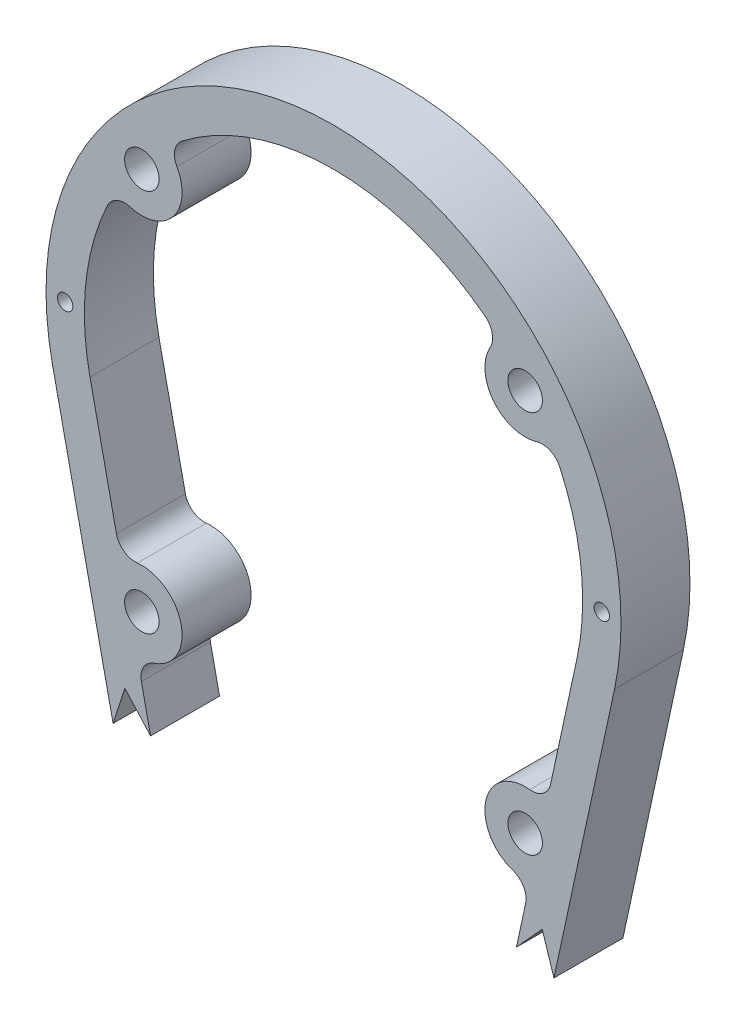
ISO-10303-21;
HEADER;
FILE_DESCRIPTION(('STEP AP214'),'2;1');
FILE_NAME('part.step','',(''),(''),'','','');
FILE_SCHEMA(('AUTOMOTIVE_DESIGN { 1 0 10303 214 1 1 1 1 }'));
ENDSEC;
DATA;
#1=APPLICATION_CONTEXT('core data for automotive mechanical design processes');
#2=APPLICATION_PROTOCOL_DEFINITION('international standard','automotive_design',2000,#1);
#3=PRODUCT_CONTEXT('',#1,'mechanical');
#4=PRODUCT('Part','Part','',(#3));
#5=PRODUCT_RELATED_PRODUCT_CATEGORY('part','',(#4));
#6=PRODUCT_DEFINITION_FORMATION('','',#4);
#7=PRODUCT_DEFINITION_CONTEXT('part definition',#1,'design');
#8=PRODUCT_DEFINITION('design','',#6,#7);
#9=PRODUCT_DEFINITION_SHAPE('','',#8);
#10=(LENGTH_UNIT() NAMED_UNIT(*) SI_UNIT(.MILLI.,.METRE.));
#11=(NAMED_UNIT(*) PLANE_ANGLE_UNIT() SI_UNIT($,.RADIAN.));
#12=(NAMED_UNIT(*) SI_UNIT($,.STERADIAN.) SOLID_ANGLE_UNIT());
#13=UNCERTAINTY_MEASURE_WITH_UNIT(LENGTH_MEASURE(1.E-05),#10,'distance_accuracy_value','');
#14=(GEOMETRIC_REPRESENTATION_CONTEXT(3) GLOBAL_UNCERTAINTY_ASSIGNED_CONTEXT((#13)) GLOBAL_UNIT_ASSIGNED_CONTEXT((#10,
#11,#12)) REPRESENTATION_CONTEXT('',''));
#15=CARTESIAN_POINT('',(0.,0.,0.));
#16=DIRECTION('',(0.,0.,1.));
#17=DIRECTION('',(1.,0.,0.));
#18=AXIS2_PLACEMENT_3D('',#15,#16,#17);
#19=CARTESIAN_POINT('',(-31.9298733487398,-112.5,18.));
#20=DIRECTION('',(0.,0.,1.));
#21=DIRECTION('',(1.,0.,0.));
#22=AXIS2_PLACEMENT_3D('',#19,#20,#21);
#23=PLANE('',#22);
#24=CARTESIAN_POINT('',(70.,47.5,18.));
#25=DIRECTION('',(0.,0.,1.));
#26=DIRECTION('',(1.,0.,0.));
#27=AXIS2_PLACEMENT_3D('',#24,#25,#26);
#28=CIRCLE('',#27,2.);
#29=CARTESIAN_POINT('',(72.,47.5,18.));
#30=VERTEX_POINT('',#29);
#31=EDGE_CURVE('E558',#30,#30,#28,.T.);
#32=ORIENTED_EDGE('',*,*,#31,.F.);
#33=EDGE_LOOP('',(#32));
#34=FACE_BOUND('',#33,.T.);
#35=CARTESIAN_POINT('',(-70.,47.5,18.));
#36=DIRECTION('',(0.,0.,1.));
#37=DIRECTION('',(1.,0.,0.));
#38=AXIS2_PLACEMENT_3D('',#35,#36,#37);
#39=CIRCLE('',#38,2.);
#40=CARTESIAN_POINT('',(-68.,47.5,18.));
#41=VERTEX_POINT('',#40);
#42=EDGE_CURVE('E552',#41,#41,#39,.T.);
#43=ORIENTED_EDGE('',*,*,#42,.F.);
#44=EDGE_LOOP('',(#43));
#45=FACE_BOUND('',#44,.T.);
#46=DIRECTION('',(-0.306753150837407,-0.95178910713,0.));
#47=VECTOR('',#46,1.);
#48=CARTESIAN_POINT('',(-57.5063561450649,-41.4755483598365,18.));
#49=LINE('',#48,#47);
#50=CARTESIAN_POINT('',(-54.4439824625953,-31.9736609139237,18.));
#51=VERTEX_POINT('',#50);
#52=CARTESIAN_POINT('',(-57.5063561450649,-41.4755483598365,18.));
#53=VERTEX_POINT('',#52);
#54=EDGE_CURVE('E218',#51,#53,#49,.T.);
#55=ORIENTED_EDGE('',*,*,#54,.F.);
#56=DIRECTION('',(-0.67089697040122,0.741550574881083,0.));
#57=VECTOR('',#56,1.);
#58=CARTESIAN_POINT('',(-54.4439824625953,-31.9736609139237,18.));
#59=LINE('',#58,#57);
#60=CARTESIAN_POINT('',(-47.7236876934698,-39.4016843948391,18.));
#61=VERTEX_POINT('',#60);
#62=EDGE_CURVE('E543',#61,#51,#59,.T.);
#63=ORIENTED_EDGE('',*,*,#62,.F.);
#64=DIRECTION('',(0.211189373172623,-0.977445164016353,0.));
#65=VECTOR('',#64,1.);
#66=CARTESIAN_POINT('',(-31.9298733487398,-112.5,18.));
#67=LINE('',#66,#65);
#68=CARTESIAN_POINT('',(-50.1212592306133,-28.3050337009208,18.));
#69=VERTEX_POINT('',#68);
#70=EDGE_CURVE('E364',#69,#61,#67,.T.);
#71=ORIENTED_EDGE('',*,*,#70,.F.);
#72=CARTESIAN_POINT('',(-45.2340334105316,-27.2490868350576,18.));
#73=DIRECTION('',(0.,0.,1.));
#74=DIRECTION('',(1.,0.,0.));
#75=AXIS2_PLACEMENT_3D('',#72,#73,#74);
#76=CIRCLE('',#75,5.);
#77=CARTESIAN_POINT('',(-46.7714419877795,-22.4913168882649,18.));
#78=VERTEX_POINT('',#77);
#79=EDGE_CURVE('E306',#69,#78,#76,.F.);
#80=ORIENTED_EDGE('',*,*,#79,.T.);
#81=CARTESIAN_POINT('',(-50.,-12.5,18.));
#82=DIRECTION('',(0.,0.,-1.));
#83=DIRECTION('',(1.,0.,0.));
#84=AXIS2_PLACEMENT_3D('',#81,#82,#83);
#85=CIRCLE('',#84,10.5);
#86=CARTESIAN_POINT('',(-51.1843712947804,-2.06701075261266,18.));
#87=VERTEX_POINT('',#86);
#88=EDGE_CURVE('E361',#87,#78,#85,.T.);
#89=ORIENTED_EDGE('',*,*,#88,.F.);
#90=CARTESIAN_POINT('',(-51.7483576256283,2.90107936519085,18.));
#91=DIRECTION('',(0.,0.,1.));
#92=DIRECTION('',(1.,0.,0.));
#93=AXIS2_PLACEMENT_3D('',#90,#91,#92);
#94=CIRCLE('',#93,5.);
#95=CARTESIAN_POINT('',(-56.63558344571,1.84513249932773,18.));
#96=VERTEX_POINT('',#95);
#97=EDGE_CURVE('E293',#87,#96,#94,.F.);
#98=ORIENTED_EDGE('',*,*,#97,.T.);
#99=DIRECTION('',(0.211189373172623,-0.977445164016353,0.));
#100=VECTOR('',#99,1.);
#101=CARTESIAN_POINT('',(-55.4723236772757,-3.53876830055558,18.));
#102=LINE('',#101,#100);
#103=CARTESIAN_POINT('',(-63.5339356610629,33.7726907437795,18.));
#104=VERTEX_POINT('',#103);
#105=EDGE_CURVE('E352',#104,#96,#102,.T.);
#106=ORIENTED_EDGE('',*,*,#105,.F.);
#107=CARTESIAN_POINT('',(0.,47.5,18.));
#108=DIRECTION('',(0.,0.,1.));
#109=DIRECTION('',(1.,0.,0.));
#110=AXIS2_PLACEMENT_3D('',#107,#108,#109);
#111=CIRCLE('',#110,65.);
#112=CARTESIAN_POINT('',(-59.0097536999229,74.755255791763,18.));
#113=VERTEX_POINT('',#112);
#114=EDGE_CURVE('E346',#113,#104,#111,.T.);
#115=ORIENTED_EDGE('',*,*,#114,.F.);
#116=CARTESIAN_POINT('',(-54.4705418768519,72.6586976539351,18.));
#117=DIRECTION('',(0.,0.,1.));
#118=DIRECTION('',(1.,0.,0.));
#119=AXIS2_PLACEMENT_3D('',#116,#117,#118);
#120=CIRCLE('',#119,5.);
#121=CARTESIAN_POINT('',(-53.0284315939965,77.4462145397625,18.));
#122=VERTEX_POINT('',#121);
#123=EDGE_CURVE('E11',#113,#122,#120,.F.);
#124=ORIENTED_EDGE('',*,*,#123,.T.);
#125=CARTESIAN_POINT('',(-50.,87.5,18.));
#126=DIRECTION('',(0.,0.,-1.));
#127=DIRECTION('',(1.,0.,0.));
#128=AXIS2_PLACEMENT_3D('',#125,#126,#127);
#129=CIRCLE('',#128,10.5);
#130=CARTESIAN_POINT('',(-40.8562064862553,92.661495924439,18.));
#131=VERTEX_POINT('',#130);
#132=EDGE_CURVE('E343',#131,#122,#129,.T.);
#133=ORIENTED_EDGE('',*,*,#132,.F.);
#134=CARTESIAN_POINT('',(-36.5020190987578,95.1193511265528,18.));
#135=DIRECTION('',(0.,0.,1.));
#136=DIRECTION('',(1.,0.,0.));
#137=AXIS2_PLACEMENT_3D('',#134,#135,#136);
#138=CIRCLE('',#137,5.);
#139=CARTESIAN_POINT('',(-39.5438540236543,99.0876303870988,18.));
#140=VERTEX_POINT('',#139);
#141=EDGE_CURVE('E318',#131,#140,#138,.F.);
#142=ORIENTED_EDGE('',*,*,#141,.T.);
#143=CARTESIAN_POINT('',(0.,47.5,18.));
#144=DIRECTION('',(0.,0.,1.));
#145=DIRECTION('',(1.,0.,0.));
#146=AXIS2_PLACEMENT_3D('',#143,#144,#145);
#147=CIRCLE('',#146,65.);
#148=CARTESIAN_POINT('',(39.5438540236543,99.0876303870988,18.));
#149=VERTEX_POINT('',#148);
#150=EDGE_CURVE('E350',#149,#140,#147,.T.);
#151=ORIENTED_EDGE('',*,*,#150,.F.);
#152=CARTESIAN_POINT('',(36.5020190987578,95.1193511265527,18.));
#153=DIRECTION('',(0.,0.,1.));
#154=DIRECTION('',(1.,0.,0.));
#155=AXIS2_PLACEMENT_3D('',#152,#153,#154);
#156=CIRCLE('',#155,5.);
#157=CARTESIAN_POINT('',(40.8562064862553,92.6614959244389,18.));
#158=VERTEX_POINT('',#157);
#159=EDGE_CURVE('E314',#149,#158,#156,.F.);
#160=ORIENTED_EDGE('',*,*,#159,.T.);
#161=CARTESIAN_POINT('',(50.,87.5,18.));
#162=DIRECTION('',(0.,0.,-1.));
#163=DIRECTION('',(1.,0.,0.));
#164=AXIS2_PLACEMENT_3D('',#161,#162,#163);
#165=CIRCLE('',#164,10.5);
#166=CARTESIAN_POINT('',(53.0284315939965,77.4462145397625,18.));
#167=VERTEX_POINT('',#166);
#168=EDGE_CURVE('E355',#167,#158,#165,.T.);
#169=ORIENTED_EDGE('',*,*,#168,.F.);
#170=CARTESIAN_POINT('',(54.470541876852,72.6586976539351,18.));
#171=DIRECTION('',(0.,0.,1.));
#172=DIRECTION('',(1.,0.,0.));
#173=AXIS2_PLACEMENT_3D('',#170,#171,#172);
#174=CIRCLE('',#173,5.);
#175=CARTESIAN_POINT('',(59.009753699923,74.755255791763,18.));
#176=VERTEX_POINT('',#175);
#177=EDGE_CURVE('E310',#167,#176,#174,.F.);
#178=ORIENTED_EDGE('',*,*,#177,.T.);
#179=CARTESIAN_POINT('',(0.,47.5,18.));
#180=DIRECTION('',(0.,0.,1.));
#181=DIRECTION('',(1.,0.,0.));
#182=AXIS2_PLACEMENT_3D('',#179,#180,#181);
#183=CIRCLE('',#182,65.);
#184=CARTESIAN_POINT('',(63.5339356610629,33.7726907437795,18.));
#185=VERTEX_POINT('',#184);
#186=EDGE_CURVE('E446',#185,#176,#183,.T.);
#187=ORIENTED_EDGE('',*,*,#186,.F.);
#188=DIRECTION('',(0.211189373172623,0.977445164016353,0.));
#189=VECTOR('',#188,1.);
#190=CARTESIAN_POINT('',(55.4723236772757,-3.53876830055554,18.));
#191=LINE('',#190,#189);
#192=CARTESIAN_POINT('',(56.63558344571,1.84513249932773,18.));
#193=VERTEX_POINT('',#192);
#194=EDGE_CURVE('E444',#193,#185,#191,.T.);
#195=ORIENTED_EDGE('',*,*,#194,.F.);
#196=CARTESIAN_POINT('',(51.7483576256282,2.90107936519085,18.));
#197=DIRECTION('',(0.,0.,1.));
#198=DIRECTION('',(1.,0.,0.));
#199=AXIS2_PLACEMENT_3D('',#196,#197,#198);
#200=CIRCLE('',#199,5.);
#201=CARTESIAN_POINT('',(51.1843712947804,-2.06701075261265,18.));
#202=VERTEX_POINT('',#201);
#203=EDGE_CURVE('E297',#193,#202,#200,.F.);
#204=ORIENTED_EDGE('',*,*,#203,.T.);
#205=CARTESIAN_POINT('',(50.,-12.5,18.));
#206=DIRECTION('',(0.,0.,-1.));
#207=DIRECTION('',(1.,0.,0.));
#208=AXIS2_PLACEMENT_3D('',#205,#206,#207);
#209=CIRCLE('',#208,10.5);
#210=CARTESIAN_POINT('',(46.7714419877795,-22.4913168882648,18.));
#211=VERTEX_POINT('',#210);
#212=EDGE_CURVE('E394',#211,#202,#209,.T.);
#213=ORIENTED_EDGE('',*,*,#212,.F.);
#214=CARTESIAN_POINT('',(45.2340334105316,-27.2490868350576,18.));
#215=DIRECTION('',(0.,0.,1.));
#216=DIRECTION('',(1.,0.,0.));
#217=AXIS2_PLACEMENT_3D('',#214,#215,#216);
#218=CIRCLE('',#217,5.);
#219=CARTESIAN_POINT('',(50.1212592306133,-28.3050337009207,18.));
#220=VERTEX_POINT('',#219);
#221=EDGE_CURVE('E301',#211,#220,#218,.F.);
#222=ORIENTED_EDGE('',*,*,#221,.T.);
#223=DIRECTION('',(0.211189373172623,0.977445164016353,0.));
#224=VECTOR('',#223,1.);
#225=CARTESIAN_POINT('',(31.9298733487398,-112.5,18.));
#226=LINE('',#225,#224);
#227=CARTESIAN_POINT('',(47.7244032118376,-39.3983727700264,18.));
#228=VERTEX_POINT('',#227);
#229=EDGE_CURVE('E367',#228,#220,#226,.T.);
#230=ORIENTED_EDGE('',*,*,#229,.F.);
#231=DIRECTION('',(-0.670959777554308,-0.741493747043273,0.));
#232=VECTOR('',#231,1.);
#233=CARTESIAN_POINT('',(47.7244032118376,-39.3983727700264,18.));
#234=LINE('',#233,#232);
#235=CARTESIAN_POINT('',(54.4443390688109,-31.9720104377862,18.));
#236=VERTEX_POINT('',#235);
#237=EDGE_CURVE('E58',#236,#228,#234,.T.);
#238=ORIENTED_EDGE('',*,*,#237,.F.);
#239=DIRECTION('',(-0.306672532909785,0.951815085801174,0.));
#240=VECTOR('',#239,1.);
#241=CARTESIAN_POINT('',(54.4443390688109,-31.9720104377862,18.));
#242=LINE('',#241,#240);
#243=CARTESIAN_POINT('',(57.5063561450649,-41.4755483598365,18.));
#244=VERTEX_POINT('',#243);
#245=EDGE_CURVE('E542',#244,#236,#242,.T.);
#246=ORIENTED_EDGE('',*,*,#245,.F.);
#247=DIRECTION('',(0.211189373172623,0.977445164016353,0.));
#248=VECTOR('',#247,1.);
#249=CARTESIAN_POINT('',(41.7043249889033,-114.611893731726,18.));
#250=LINE('',#249,#248);
#251=CARTESIAN_POINT('',(73.3083873012265,31.6607970120533,18.));
#252=VERTEX_POINT('',#251);
#253=EDGE_CURVE('E226',#244,#252,#250,.T.);
#254=ORIENTED_EDGE('',*,*,#253,.T.);
#255=CARTESIAN_POINT('',(0.,47.5,18.));
#256=DIRECTION('',(0.,0.,1.));
#257=DIRECTION('',(1.,0.,0.));
#258=AXIS2_PLACEMENT_3D('',#255,#256,#257);
#259=CIRCLE('',#258,75.);
#260=CARTESIAN_POINT('',(-73.3083873012264,31.6607970120533,18.));
#261=VERTEX_POINT('',#260);
#262=EDGE_CURVE('E419',#252,#261,#259,.T.);
#263=ORIENTED_EDGE('',*,*,#262,.T.);
#264=DIRECTION('',(0.211189373172623,-0.977445164016353,0.));
#265=VECTOR('',#264,1.);
#266=CARTESIAN_POINT('',(-73.3083873012264,31.6607970120533,18.));
#267=LINE('',#266,#265);
#268=EDGE_CURVE('E241',#261,#53,#267,.T.);
#269=ORIENTED_EDGE('',*,*,#268,.T.);
#270=EDGE_LOOP('',(#55,#63,#71,#80,#89,#98,#106,#115,#124,#133,#142,#151,#160,#169,#178,#187,
#195,#204,#213,#222,#230,#238,#246,#254,#263,#269));
#271=FACE_BOUND('',#270,.T.);
#272=CARTESIAN_POINT('',(-50.,87.5,18.));
#273=DIRECTION('',(0.,0.,1.));
#274=DIRECTION('',(1.,0.,0.));
#275=AXIS2_PLACEMENT_3D('',#272,#273,#274);
#276=CIRCLE('',#275,4.5);
#277=CARTESIAN_POINT('',(-45.5,87.5,18.));
#278=VERTEX_POINT('',#277);
#279=EDGE_CURVE('E406',#278,#278,#276,.T.);
#280=ORIENTED_EDGE('',*,*,#279,.F.);
#281=EDGE_LOOP('',(#280));
#282=FACE_BOUND('',#281,.T.);
#283=CARTESIAN_POINT('',(50.,-12.5,18.));
#284=DIRECTION('',(0.,0.,1.));
#285=DIRECTION('',(1.,0.,0.));
#286=AXIS2_PLACEMENT_3D('',#283,#284,#285);
#287=CIRCLE('',#286,4.5);
#288=CARTESIAN_POINT('',(54.5,-12.5,18.));
#289=VERTEX_POINT('',#288);
#290=EDGE_CURVE('E233',#289,#289,#287,.T.);
#291=ORIENTED_EDGE('',*,*,#290,.F.);
#292=EDGE_LOOP('',(#291));
#293=FACE_BOUND('',#292,.T.);
#294=CARTESIAN_POINT('',(50.,87.5,18.));
#295=DIRECTION('',(0.,0.,1.));
#296=DIRECTION('',(1.,0.,0.));
#297=AXIS2_PLACEMENT_3D('',#294,#295,#296);
#298=CIRCLE('',#297,4.5);
#299=CARTESIAN_POINT('',(54.5,87.5,18.));
#300=VERTEX_POINT('',#299);
#301=EDGE_CURVE('E412',#300,#300,#298,.T.);
#302=ORIENTED_EDGE('',*,*,#301,.F.);
#303=EDGE_LOOP('',(#302));
#304=FACE_BOUND('',#303,.T.);
#305=CARTESIAN_POINT('',(-50.,-12.5,18.));
#306=DIRECTION('',(0.,0.,1.));
#307=DIRECTION('',(1.,0.,0.));
#308=AXIS2_PLACEMENT_3D('',#305,#306,#307);
#309=CIRCLE('',#308,4.5);
#310=CARTESIAN_POINT('',(-45.5,-12.5,18.));
#311=VERTEX_POINT('',#310);
#312=EDGE_CURVE('E400',#311,#311,#309,.T.);
#313=ORIENTED_EDGE('',*,*,#312,.F.);
#314=EDGE_LOOP('',(#313));
#315=FACE_BOUND('',#314,.T.);
#316=ADVANCED_FACE('F35',(#34,#45,#271,#282,#293,#304,#315),#23,.T.);
#317=CARTESIAN_POINT('',(-31.9298733487398,-112.5,0.));
#318=DIRECTION('',(0.,0.,1.));
#319=DIRECTION('',(1.,0.,0.));
#320=AXIS2_PLACEMENT_3D('',#317,#318,#319);
#321=PLANE('',#320);
#322=CARTESIAN_POINT('',(70.,47.5,0.));
#323=DIRECTION('',(0.,0.,1.));
#324=DIRECTION('',(1.,0.,0.));
#325=AXIS2_PLACEMENT_3D('',#322,#323,#324);
#326=CIRCLE('',#325,2.);
#327=CARTESIAN_POINT('',(72.,47.5,0.));
#328=VERTEX_POINT('',#327);
#329=EDGE_CURVE('E555',#328,#328,#326,.T.);
#330=ORIENTED_EDGE('',*,*,#329,.T.);
#331=EDGE_LOOP('',(#330));
#332=FACE_BOUND('',#331,.T.);
#333=CARTESIAN_POINT('',(-70.,47.5,0.));
#334=DIRECTION('',(0.,0.,1.));
#335=DIRECTION('',(1.,0.,0.));
#336=AXIS2_PLACEMENT_3D('',#333,#334,#335);
#337=CIRCLE('',#336,2.);
#338=CARTESIAN_POINT('',(-68.,47.5,0.));
#339=VERTEX_POINT('',#338);
#340=EDGE_CURVE('E546',#339,#339,#337,.T.);
#341=ORIENTED_EDGE('',*,*,#340,.T.);
#342=EDGE_LOOP('',(#341));
#343=FACE_BOUND('',#342,.T.);
#344=CARTESIAN_POINT('',(-50.,-12.5,0.));
#345=DIRECTION('',(0.,0.,1.));
#346=DIRECTION('',(1.,0.,0.));
#347=AXIS2_PLACEMENT_3D('',#344,#345,#346);
#348=CIRCLE('',#347,4.5);
#349=CARTESIAN_POINT('',(-45.5,-12.5,0.));
#350=VERTEX_POINT('',#349);
#351=EDGE_CURVE('E399',#350,#350,#348,.T.);
#352=ORIENTED_EDGE('',*,*,#351,.T.);
#353=EDGE_LOOP('',(#352));
#354=FACE_BOUND('',#353,.T.);
#355=CARTESIAN_POINT('',(-50.,87.5,0.));
#356=DIRECTION('',(0.,0.,1.));
#357=DIRECTION('',(1.,0.,0.));
#358=AXIS2_PLACEMENT_3D('',#355,#356,#357);
#359=CIRCLE('',#358,4.5);
#360=CARTESIAN_POINT('',(-45.5,87.5,0.));
#361=VERTEX_POINT('',#360);
#362=EDGE_CURVE('E403',#361,#361,#359,.T.);
#363=ORIENTED_EDGE('',*,*,#362,.T.);
#364=EDGE_LOOP('',(#363));
#365=FACE_BOUND('',#364,.T.);
#366=CARTESIAN_POINT('',(50.,87.5,0.));
#367=DIRECTION('',(0.,0.,1.));
#368=DIRECTION('',(1.,0.,0.));
#369=AXIS2_PLACEMENT_3D('',#366,#367,#368);
#370=CIRCLE('',#369,4.5);
#371=CARTESIAN_POINT('',(54.5,87.5,0.));
#372=VERTEX_POINT('',#371);
#373=EDGE_CURVE('E409',#372,#372,#370,.T.);
#374=ORIENTED_EDGE('',*,*,#373,.T.);
#375=EDGE_LOOP('',(#374));
#376=FACE_BOUND('',#375,.T.);
#377=CARTESIAN_POINT('',(50.,-12.5,0.));
#378=DIRECTION('',(0.,0.,1.));
#379=DIRECTION('',(1.,0.,0.));
#380=AXIS2_PLACEMENT_3D('',#377,#378,#379);
#381=CIRCLE('',#380,4.5);
#382=CARTESIAN_POINT('',(54.5,-12.5,0.));
#383=VERTEX_POINT('',#382);
#384=EDGE_CURVE('E238',#383,#383,#381,.T.);
#385=ORIENTED_EDGE('',*,*,#384,.T.);
#386=EDGE_LOOP('',(#385));
#387=FACE_BOUND('',#386,.T.);
#388=DIRECTION('',(-0.67089697040122,0.741550574881083,0.));
#389=VECTOR('',#388,1.);
#390=CARTESIAN_POINT('',(-54.4439824625953,-31.9736609139237,0.));
#391=LINE('',#390,#389);
#392=CARTESIAN_POINT('',(-47.7236876934698,-39.4016843948391,0.));
#393=VERTEX_POINT('',#392);
#394=CARTESIAN_POINT('',(-54.4439824625953,-31.9736609139237,0.));
#395=VERTEX_POINT('',#394);
#396=EDGE_CURVE('E50',#393,#395,#391,.T.);
#397=ORIENTED_EDGE('',*,*,#396,.T.);
#398=DIRECTION('',(-0.306753150837407,-0.95178910713,0.));
#399=VECTOR('',#398,1.);
#400=CARTESIAN_POINT('',(-57.5063561450649,-41.4755483598365,0.));
#401=LINE('',#400,#399);
#402=CARTESIAN_POINT('',(-57.5063561450649,-41.4755483598365,0.));
#403=VERTEX_POINT('',#402);
#404=EDGE_CURVE('E227',#395,#403,#401,.T.);
#405=ORIENTED_EDGE('',*,*,#404,.T.);
#406=DIRECTION('',(0.211189373172623,-0.977445164016353,0.));
#407=VECTOR('',#406,1.);
#408=CARTESIAN_POINT('',(-73.3083873012264,31.6607970120533,0.));
#409=LINE('',#408,#407);
#410=CARTESIAN_POINT('',(-73.3083873012264,31.6607970120533,0.));
#411=VERTEX_POINT('',#410);
#412=EDGE_CURVE('E235',#411,#403,#409,.T.);
#413=ORIENTED_EDGE('',*,*,#412,.F.);
#414=CARTESIAN_POINT('',(0.,47.5,0.));
#415=DIRECTION('',(0.,0.,1.));
#416=DIRECTION('',(1.,0.,0.));
#417=AXIS2_PLACEMENT_3D('',#414,#415,#416);
#418=CIRCLE('',#417,75.);
#419=CARTESIAN_POINT('',(73.3083873012265,31.6607970120533,0.));
#420=VERTEX_POINT('',#419);
#421=EDGE_CURVE('E232',#420,#411,#418,.T.);
#422=ORIENTED_EDGE('',*,*,#421,.F.);
#423=DIRECTION('',(0.211189373172623,0.977445164016353,0.));
#424=VECTOR('',#423,1.);
#425=CARTESIAN_POINT('',(41.7043249889033,-114.611893731726,0.));
#426=LINE('',#425,#424);
#427=CARTESIAN_POINT('',(57.5063561450649,-41.4755483598365,0.));
#428=VERTEX_POINT('',#427);
#429=EDGE_CURVE('E224',#428,#420,#426,.T.);
#430=ORIENTED_EDGE('',*,*,#429,.F.);
#431=DIRECTION('',(-0.306672532909785,0.951815085801174,0.));
#432=VECTOR('',#431,1.);
#433=CARTESIAN_POINT('',(54.4443390688109,-31.9720104377862,0.));
#434=LINE('',#433,#432);
#435=CARTESIAN_POINT('',(54.4443390688109,-31.9720104377862,0.));
#436=VERTEX_POINT('',#435);
#437=EDGE_CURVE('E206',#428,#436,#434,.T.);
#438=ORIENTED_EDGE('',*,*,#437,.T.);
#439=DIRECTION('',(-0.670959777554308,-0.741493747043273,0.));
#440=VECTOR('',#439,1.);
#441=CARTESIAN_POINT('',(47.7244032118376,-39.3983727700264,0.));
#442=LINE('',#441,#440);
#443=CARTESIAN_POINT('',(47.7244032118376,-39.3983727700264,0.));
#444=VERTEX_POINT('',#443);
#445=EDGE_CURVE('E217',#436,#444,#442,.T.);
#446=ORIENTED_EDGE('',*,*,#445,.T.);
#447=DIRECTION('',(0.211189373172623,0.977445164016353,0.));
#448=VECTOR('',#447,1.);
#449=CARTESIAN_POINT('',(31.9298733487398,-112.5,0.));
#450=LINE('',#449,#448);
#451=CARTESIAN_POINT('',(50.1212592306133,-28.3050337009207,0.));
#452=VERTEX_POINT('',#451);
#453=EDGE_CURVE('E392',#444,#452,#450,.T.);
#454=ORIENTED_EDGE('',*,*,#453,.T.);
#455=CARTESIAN_POINT('',(45.2340334105316,-27.2490868350576,0.));
#456=DIRECTION('',(0.,0.,1.));
#457=DIRECTION('',(1.,0.,0.));
#458=AXIS2_PLACEMENT_3D('',#455,#456,#457);
#459=CIRCLE('',#458,5.);
#460=CARTESIAN_POINT('',(46.7714419877795,-22.4913168882648,0.));
#461=VERTEX_POINT('',#460);
#462=EDGE_CURVE('E299',#452,#461,#459,.T.);
#463=ORIENTED_EDGE('',*,*,#462,.T.);
#464=CARTESIAN_POINT('',(50.,-12.5,0.));
#465=DIRECTION('',(0.,0.,-1.));
#466=DIRECTION('',(1.,0.,0.));
#467=AXIS2_PLACEMENT_3D('',#464,#465,#466);
#468=CIRCLE('',#467,10.5);
#469=CARTESIAN_POINT('',(51.1843712947804,-2.06701075261265,0.));
#470=VERTEX_POINT('',#469);
#471=EDGE_CURVE('E369',#461,#470,#468,.T.);
#472=ORIENTED_EDGE('',*,*,#471,.T.);
#473=CARTESIAN_POINT('',(51.7483576256282,2.90107936519085,0.));
#474=DIRECTION('',(0.,0.,1.));
#475=DIRECTION('',(1.,0.,0.));
#476=AXIS2_PLACEMENT_3D('',#473,#474,#475);
#477=CIRCLE('',#476,5.);
#478=CARTESIAN_POINT('',(56.63558344571,1.84513249932773,0.));
#479=VERTEX_POINT('',#478);
#480=EDGE_CURVE('E295',#470,#479,#477,.T.);
#481=ORIENTED_EDGE('',*,*,#480,.T.);
#482=DIRECTION('',(0.211189373172623,0.977445164016353,0.));
#483=VECTOR('',#482,1.);
#484=CARTESIAN_POINT('',(55.4723236772757,-3.53876830055554,0.));
#485=LINE('',#484,#483);
#486=CARTESIAN_POINT('',(63.5339356610629,33.7726907437795,0.));
#487=VERTEX_POINT('',#486);
#488=EDGE_CURVE('E372',#479,#487,#485,.T.);
#489=ORIENTED_EDGE('',*,*,#488,.T.);
#490=CARTESIAN_POINT('',(0.,47.5,0.));
#491=DIRECTION('',(0.,0.,1.));
#492=DIRECTION('',(1.,0.,0.));
#493=AXIS2_PLACEMENT_3D('',#490,#491,#492);
#494=CIRCLE('',#493,65.);
#495=CARTESIAN_POINT('',(59.009753699923,74.755255791763,0.));
#496=VERTEX_POINT('',#495);
#497=EDGE_CURVE('E375',#487,#496,#494,.T.);
#498=ORIENTED_EDGE('',*,*,#497,.T.);
#499=CARTESIAN_POINT('',(54.470541876852,72.6586976539351,0.));
#500=DIRECTION('',(0.,0.,1.));
#501=DIRECTION('',(1.,0.,0.));
#502=AXIS2_PLACEMENT_3D('',#499,#500,#501);
#503=CIRCLE('',#502,5.);
#504=CARTESIAN_POINT('',(53.0284315939965,77.4462145397625,0.));
#505=VERTEX_POINT('',#504);
#506=EDGE_CURVE('E308',#496,#505,#503,.T.);
#507=ORIENTED_EDGE('',*,*,#506,.T.);
#508=CARTESIAN_POINT('',(50.,87.5,0.));
#509=DIRECTION('',(0.,0.,-1.));
#510=DIRECTION('',(1.,0.,0.));
#511=AXIS2_PLACEMENT_3D('',#508,#509,#510);
#512=CIRCLE('',#511,10.5);
#513=CARTESIAN_POINT('',(40.8562064862553,92.6614959244389,0.));
#514=VERTEX_POINT('',#513);
#515=EDGE_CURVE('E378',#505,#514,#512,.T.);
#516=ORIENTED_EDGE('',*,*,#515,.T.);
#517=CARTESIAN_POINT('',(36.5020190987578,95.1193511265527,0.));
#518=DIRECTION('',(0.,0.,1.));
#519=DIRECTION('',(1.,0.,0.));
#520=AXIS2_PLACEMENT_3D('',#517,#518,#519);
#521=CIRCLE('',#520,5.);
#522=CARTESIAN_POINT('',(39.5438540236543,99.0876303870988,0.));
#523=VERTEX_POINT('',#522);
#524=EDGE_CURVE('E312',#514,#523,#521,.T.);
#525=ORIENTED_EDGE('',*,*,#524,.T.);
#526=CARTESIAN_POINT('',(0.,47.5,0.));
#527=DIRECTION('',(0.,0.,1.));
#528=DIRECTION('',(1.,0.,0.));
#529=AXIS2_PLACEMENT_3D('',#526,#527,#528);
#530=CIRCLE('',#529,65.);
#531=CARTESIAN_POINT('',(-39.5438540236543,99.0876303870988,0.));
#532=VERTEX_POINT('',#531);
#533=EDGE_CURVE('E381',#523,#532,#530,.T.);
#534=ORIENTED_EDGE('',*,*,#533,.T.);
#535=CARTESIAN_POINT('',(-36.5020190987578,95.1193511265528,0.));
#536=DIRECTION('',(0.,0.,1.));
#537=DIRECTION('',(1.,0.,0.));
#538=AXIS2_PLACEMENT_3D('',#535,#536,#537);
#539=CIRCLE('',#538,5.);
#540=CARTESIAN_POINT('',(-40.8562064862553,92.661495924439,0.));
#541=VERTEX_POINT('',#540);
#542=EDGE_CURVE('E316',#532,#541,#539,.T.);
#543=ORIENTED_EDGE('',*,*,#542,.T.);
#544=CARTESIAN_POINT('',(-50.,87.5,0.));
#545=DIRECTION('',(0.,0.,-1.));
#546=DIRECTION('',(1.,0.,0.));
#547=AXIS2_PLACEMENT_3D('',#544,#545,#546);
#548=CIRCLE('',#547,10.5);
#549=CARTESIAN_POINT('',(-53.0284315939965,77.4462145397625,0.));
#550=VERTEX_POINT('',#549);
#551=EDGE_CURVE('E325',#541,#550,#548,.T.);
#552=ORIENTED_EDGE('',*,*,#551,.T.);
#553=CARTESIAN_POINT('',(-54.4705418768519,72.6586976539351,0.));
#554=DIRECTION('',(0.,0.,1.));
#555=DIRECTION('',(1.,0.,0.));
#556=AXIS2_PLACEMENT_3D('',#553,#554,#555);
#557=CIRCLE('',#556,5.);
#558=CARTESIAN_POINT('',(-59.0097536999229,74.755255791763,0.));
#559=VERTEX_POINT('',#558);
#560=EDGE_CURVE('E43',#550,#559,#557,.T.);
#561=ORIENTED_EDGE('',*,*,#560,.T.);
#562=CARTESIAN_POINT('',(0.,47.5,0.));
#563=DIRECTION('',(0.,0.,1.));
#564=DIRECTION('',(1.,0.,0.));
#565=AXIS2_PLACEMENT_3D('',#562,#563,#564);
#566=CIRCLE('',#565,65.);
#567=CARTESIAN_POINT('',(-63.5339356610629,33.7726907437795,0.));
#568=VERTEX_POINT('',#567);
#569=EDGE_CURVE('E322',#559,#568,#566,.T.);
#570=ORIENTED_EDGE('',*,*,#569,.T.);
#571=DIRECTION('',(0.211189373172623,-0.977445164016353,0.));
#572=VECTOR('',#571,1.);
#573=CARTESIAN_POINT('',(-55.4723236772757,-3.53876830055558,0.));
#574=LINE('',#573,#572);
#575=CARTESIAN_POINT('',(-56.63558344571,1.84513249932773,0.));
#576=VERTEX_POINT('',#575);
#577=EDGE_CURVE('E335',#568,#576,#574,.T.);
#578=ORIENTED_EDGE('',*,*,#577,.T.);
#579=CARTESIAN_POINT('',(-51.7483576256283,2.90107936519085,0.));
#580=DIRECTION('',(0.,0.,1.));
#581=DIRECTION('',(1.,0.,0.));
#582=AXIS2_PLACEMENT_3D('',#579,#580,#581);
#583=CIRCLE('',#582,5.);
#584=CARTESIAN_POINT('',(-51.1843712947804,-2.06701075261266,0.));
#585=VERTEX_POINT('',#584);
#586=EDGE_CURVE('E291',#576,#585,#583,.T.);
#587=ORIENTED_EDGE('',*,*,#586,.T.);
#588=CARTESIAN_POINT('',(-50.,-12.5,0.));
#589=DIRECTION('',(0.,0.,-1.));
#590=DIRECTION('',(1.,0.,0.));
#591=AXIS2_PLACEMENT_3D('',#588,#589,#590);
#592=CIRCLE('',#591,10.5);
#593=CARTESIAN_POINT('',(-46.7714419877795,-22.4913168882649,0.));
#594=VERTEX_POINT('',#593);
#595=EDGE_CURVE('E386',#585,#594,#592,.T.);
#596=ORIENTED_EDGE('',*,*,#595,.T.);
#597=CARTESIAN_POINT('',(-45.2340334105316,-27.2490868350576,0.));
#598=DIRECTION('',(0.,0.,1.));
#599=DIRECTION('',(1.,0.,0.));
#600=AXIS2_PLACEMENT_3D('',#597,#598,#599);
#601=CIRCLE('',#600,5.);
#602=CARTESIAN_POINT('',(-50.1212592306133,-28.3050337009208,0.));
#603=VERTEX_POINT('',#602);
#604=EDGE_CURVE('E304',#594,#603,#601,.T.);
#605=ORIENTED_EDGE('',*,*,#604,.T.);
#606=DIRECTION('',(0.211189373172623,-0.977445164016353,0.));
#607=VECTOR('',#606,1.);
#608=CARTESIAN_POINT('',(-31.9298733487398,-112.5,0.));
#609=LINE('',#608,#607);
#610=EDGE_CURVE('E389',#603,#393,#609,.T.);
#611=ORIENTED_EDGE('',*,*,#610,.T.);
#612=EDGE_LOOP('',(#397,#405,#413,#422,#430,#438,#446,#454,#463,#472,#481,#489,#498,#507,#516,
#525,#534,#543,#552,#561,#570,#578,#587,#596,#605,#611));
#613=FACE_BOUND('',#612,.T.);
#614=ADVANCED_FACE('F230',(#332,#343,#354,#365,#376,#387,#613),#321,.F.);
#615=CARTESIAN_POINT('',(41.7043249889033,-114.611893731726,18.));
#616=DIRECTION('',(-0.977445164016353,0.211189373172623,0.));
#617=DIRECTION('',(-0.211189373172623,-0.977445164016353,0.));
#618=AXIS2_PLACEMENT_3D('',#615,#616,#617);
#619=PLANE('',#618);
#620=ORIENTED_EDGE('',*,*,#253,.F.);
#621=DIRECTION('',(0.,0.,1.));
#622=VECTOR('',#621,1.);
#623=CARTESIAN_POINT('',(57.5063561450649,-41.4755483598365,0.));
#624=LINE('',#623,#622);
#625=EDGE_CURVE('E210',#428,#244,#624,.T.);
#626=ORIENTED_EDGE('',*,*,#625,.F.);
#627=ORIENTED_EDGE('',*,*,#429,.T.);
#628=DIRECTION('',(0.,0.,-1.));
#629=VECTOR('',#628,1.);
#630=CARTESIAN_POINT('',(73.3083873012265,31.6607970120533,18.));
#631=LINE('',#630,#629);
#632=EDGE_CURVE('E249',#252,#420,#631,.T.);
#633=ORIENTED_EDGE('',*,*,#632,.F.);
#634=EDGE_LOOP('',(#620,#626,#627,#633));
#635=FACE_BOUND('',#634,.T.);
#636=ADVANCED_FACE('F222',(#635),#619,.F.);
#637=CARTESIAN_POINT('',(0.,47.5,18.));
#638=DIRECTION('',(0.,0.,-1.));
#639=DIRECTION('',(-1.,0.,0.));
#640=AXIS2_PLACEMENT_3D('',#637,#638,#639);
#641=CYLINDRICAL_SURFACE('',#640,75.);
#642=ORIENTED_EDGE('',*,*,#421,.T.);
#643=DIRECTION('',(0.,0.,-1.));
#644=VECTOR('',#643,1.);
#645=CARTESIAN_POINT('',(-73.3083873012264,31.6607970120533,18.));
#646=LINE('',#645,#644);
#647=EDGE_CURVE('E246',#261,#411,#646,.T.);
#648=ORIENTED_EDGE('',*,*,#647,.F.);
#649=ORIENTED_EDGE('',*,*,#262,.F.);
#650=ORIENTED_EDGE('',*,*,#632,.T.);
#651=EDGE_LOOP('',(#642,#648,#649,#650));
#652=FACE_BOUND('',#651,.T.);
#653=ADVANCED_FACE('F491',(#652),#641,.T.);
#654=CARTESIAN_POINT('',(-73.3083873012264,31.6607970120533,18.));
#655=DIRECTION('',(0.977445164016353,0.211189373172623,0.));
#656=DIRECTION('',(-0.211189373172623,0.977445164016353,0.));
#657=AXIS2_PLACEMENT_3D('',#654,#655,#656);
#658=PLANE('',#657);
#659=ORIENTED_EDGE('',*,*,#412,.T.);
#660=DIRECTION('',(0.,0.,1.));
#661=VECTOR('',#660,1.);
#662=CARTESIAN_POINT('',(-57.5063561450649,-41.4755483598365,0.));
#663=LINE('',#662,#661);
#664=EDGE_CURVE('E373',#403,#53,#663,.T.);
#665=ORIENTED_EDGE('',*,*,#664,.T.);
#666=ORIENTED_EDGE('',*,*,#268,.F.);
#667=ORIENTED_EDGE('',*,*,#647,.T.);
#668=EDGE_LOOP('',(#659,#665,#666,#667));
#669=FACE_BOUND('',#668,.T.);
#670=ADVANCED_FACE('F427',(#669),#658,.F.);
#671=CARTESIAN_POINT('',(50.,-12.5,18.));
#672=DIRECTION('',(0.,0.,-1.));
#673=DIRECTION('',(-1.,0.,0.));
#674=AXIS2_PLACEMENT_3D('',#671,#672,#673);
#675=CYLINDRICAL_SURFACE('',#674,4.5);
#676=ORIENTED_EDGE('',*,*,#290,.T.);
#677=EDGE_LOOP('',(#676));
#678=FACE_BOUND('',#677,.T.);
#679=ORIENTED_EDGE('',*,*,#384,.F.);
#680=EDGE_LOOP('',(#679));
#681=FACE_BOUND('',#680,.T.);
#682=ADVANCED_FACE('F486',(#678,#681),#675,.F.);
#683=CARTESIAN_POINT('',(50.,87.5,18.));
#684=DIRECTION('',(0.,0.,-1.));
#685=DIRECTION('',(-1.,0.,0.));
#686=AXIS2_PLACEMENT_3D('',#683,#684,#685);
#687=CYLINDRICAL_SURFACE('',#686,4.5);
#688=ORIENTED_EDGE('',*,*,#301,.T.);
#689=EDGE_LOOP('',(#688));
#690=FACE_BOUND('',#689,.T.);
#691=ORIENTED_EDGE('',*,*,#373,.F.);
#692=EDGE_LOOP('',(#691));
#693=FACE_BOUND('',#692,.T.);
#694=ADVANCED_FACE('F620',(#690,#693),#687,.F.);
#695=CARTESIAN_POINT('',(-50.,87.5,18.));
#696=DIRECTION('',(0.,0.,-1.));
#697=DIRECTION('',(-1.,0.,0.));
#698=AXIS2_PLACEMENT_3D('',#695,#696,#697);
#699=CYLINDRICAL_SURFACE('',#698,4.5);
#700=ORIENTED_EDGE('',*,*,#279,.T.);
#701=EDGE_LOOP('',(#700));
#702=FACE_BOUND('',#701,.T.);
#703=ORIENTED_EDGE('',*,*,#362,.F.);
#704=EDGE_LOOP('',(#703));
#705=FACE_BOUND('',#704,.T.);
#706=ADVANCED_FACE('F617',(#702,#705),#699,.F.);
#707=CARTESIAN_POINT('',(-50.,-12.5,18.));
#708=DIRECTION('',(0.,0.,-1.));
#709=DIRECTION('',(-1.,0.,0.));
#710=AXIS2_PLACEMENT_3D('',#707,#708,#709);
#711=CYLINDRICAL_SURFACE('',#710,4.5);
#712=ORIENTED_EDGE('',*,*,#312,.T.);
#713=EDGE_LOOP('',(#712));
#714=FACE_BOUND('',#713,.T.);
#715=ORIENTED_EDGE('',*,*,#351,.F.);
#716=EDGE_LOOP('',(#715));
#717=FACE_BOUND('',#716,.T.);
#718=ADVANCED_FACE('F614',(#714,#717),#711,.F.);
#719=CARTESIAN_POINT('',(50.,-12.5,18.));
#720=DIRECTION('',(0.,0.,-1.));
#721=DIRECTION('',(-1.,0.,0.));
#722=AXIS2_PLACEMENT_3D('',#719,#720,#721);
#723=CYLINDRICAL_SURFACE('',#722,10.5);
#724=ORIENTED_EDGE('',*,*,#212,.T.);
#725=DIRECTION('',(0.,0.,-1.));
#726=VECTOR('',#725,1.);
#727=CARTESIAN_POINT('',(51.1843712947804,-2.06701075261265,18.));
#728=LINE('',#727,#726);
#729=EDGE_CURVE('E261',#202,#470,#728,.T.);
#730=ORIENTED_EDGE('',*,*,#729,.T.);
#731=ORIENTED_EDGE('',*,*,#471,.F.);
#732=DIRECTION('',(0.,0.,-1.));
#733=VECTOR('',#732,1.);
#734=CARTESIAN_POINT('',(46.7714419877795,-22.4913168882648,18.));
#735=LINE('',#734,#733);
#736=EDGE_CURVE('E259',#461,#211,#735,.F.);
#737=ORIENTED_EDGE('',*,*,#736,.T.);
#738=EDGE_LOOP('',(#724,#730,#731,#737));
#739=FACE_BOUND('',#738,.T.);
#740=ADVANCED_FACE('F534',(#739),#723,.T.);
#741=CARTESIAN_POINT('',(55.4723236772757,-3.53876830055554,18.));
#742=DIRECTION('',(-0.977445164016353,0.211189373172623,0.));
#743=DIRECTION('',(-0.211189373172623,-0.977445164016353,0.));
#744=AXIS2_PLACEMENT_3D('',#741,#742,#743);
#745=PLANE('',#744);
#746=ORIENTED_EDGE('',*,*,#488,.F.);
#747=DIRECTION('',(0.,0.,1.));
#748=VECTOR('',#747,1.);
#749=CARTESIAN_POINT('',(56.63558344571,1.84513249932774,18.));
#750=LINE('',#749,#748);
#751=EDGE_CURVE('E264',#479,#193,#750,.T.);
#752=ORIENTED_EDGE('',*,*,#751,.T.);
#753=ORIENTED_EDGE('',*,*,#194,.T.);
#754=DIRECTION('',(0.,0.,-1.));
#755=VECTOR('',#754,1.);
#756=CARTESIAN_POINT('',(63.5339356610629,33.7726907437795,18.));
#757=LINE('',#756,#755);
#758=EDGE_CURVE('E396',#185,#487,#757,.T.);
#759=ORIENTED_EDGE('',*,*,#758,.T.);
#760=EDGE_LOOP('',(#746,#752,#753,#759));
#761=FACE_BOUND('',#760,.T.);
#762=ADVANCED_FACE('F527',(#761),#745,.T.);
#763=CARTESIAN_POINT('',(0.,47.5,18.));
#764=DIRECTION('',(0.,0.,-1.));
#765=DIRECTION('',(-1.,0.,0.));
#766=AXIS2_PLACEMENT_3D('',#763,#764,#765);
#767=CYLINDRICAL_SURFACE('',#766,65.);
#768=ORIENTED_EDGE('',*,*,#186,.T.);
#769=DIRECTION('',(0.,0.,-1.));
#770=VECTOR('',#769,1.);
#771=CARTESIAN_POINT('',(59.009753699923,74.755255791763,18.));
#772=LINE('',#771,#770);
#773=EDGE_CURVE('E271',#176,#496,#772,.T.);
#774=ORIENTED_EDGE('',*,*,#773,.T.);
#775=ORIENTED_EDGE('',*,*,#497,.F.);
#776=ORIENTED_EDGE('',*,*,#758,.F.);
#777=EDGE_LOOP('',(#768,#774,#775,#776));
#778=FACE_BOUND('',#777,.T.);
#779=ADVANCED_FACE('F523',(#778),#767,.F.);
#780=CARTESIAN_POINT('',(50.,87.5,18.));
#781=DIRECTION('',(0.,0.,-1.));
#782=DIRECTION('',(-1.,0.,0.));
#783=AXIS2_PLACEMENT_3D('',#780,#781,#782);
#784=CYLINDRICAL_SURFACE('',#783,10.5);
#785=ORIENTED_EDGE('',*,*,#515,.F.);
#786=DIRECTION('',(0.,0.,-1.));
#787=VECTOR('',#786,1.);
#788=CARTESIAN_POINT('',(53.0284315939965,77.4462145397625,18.));
#789=LINE('',#788,#787);
#790=EDGE_CURVE('E277',#505,#167,#789,.F.);
#791=ORIENTED_EDGE('',*,*,#790,.T.);
#792=ORIENTED_EDGE('',*,*,#168,.T.);
#793=DIRECTION('',(0.,0.,-1.));
#794=VECTOR('',#793,1.);
#795=CARTESIAN_POINT('',(40.8562064862553,92.6614959244389,18.));
#796=LINE('',#795,#794);
#797=EDGE_CURVE('E274',#158,#514,#796,.T.);
#798=ORIENTED_EDGE('',*,*,#797,.T.);
#799=EDGE_LOOP('',(#785,#791,#792,#798));
#800=FACE_BOUND('',#799,.T.);
#801=ADVANCED_FACE('F453',(#800),#784,.T.);
#802=CARTESIAN_POINT('',(0.,47.5,18.));
#803=DIRECTION('',(0.,0.,-1.));
#804=DIRECTION('',(-1.,0.,0.));
#805=AXIS2_PLACEMENT_3D('',#802,#803,#804);
#806=CYLINDRICAL_SURFACE('',#805,65.);
#807=ORIENTED_EDGE('',*,*,#533,.F.);
#808=DIRECTION('',(0.,0.,-1.));
#809=VECTOR('',#808,1.);
#810=CARTESIAN_POINT('',(39.5438540236543,99.0876303870988,18.));
#811=LINE('',#810,#809);
#812=EDGE_CURVE('E282',#523,#149,#811,.F.);
#813=ORIENTED_EDGE('',*,*,#812,.T.);
#814=ORIENTED_EDGE('',*,*,#150,.T.);
#815=DIRECTION('',(0.,0.,-1.));
#816=VECTOR('',#815,1.);
#817=CARTESIAN_POINT('',(-39.5438540236543,99.0876303870988,18.));
#818=LINE('',#817,#816);
#819=EDGE_CURVE('E279',#140,#532,#818,.T.);
#820=ORIENTED_EDGE('',*,*,#819,.T.);
#821=EDGE_LOOP('',(#807,#813,#814,#820));
#822=FACE_BOUND('',#821,.T.);
#823=ADVANCED_FACE('F462',(#822),#806,.F.);
#824=CARTESIAN_POINT('',(-50.,87.5,18.));
#825=DIRECTION('',(0.,0.,-1.));
#826=DIRECTION('',(-1.,0.,0.));
#827=AXIS2_PLACEMENT_3D('',#824,#825,#826);
#828=CYLINDRICAL_SURFACE('',#827,10.5);
#829=ORIENTED_EDGE('',*,*,#551,.F.);
#830=DIRECTION('',(0.,0.,-1.));
#831=VECTOR('',#830,1.);
#832=CARTESIAN_POINT('',(-40.8562064862553,92.661495924439,18.));
#833=LINE('',#832,#831);
#834=EDGE_CURVE('E287',#541,#131,#833,.F.);
#835=ORIENTED_EDGE('',*,*,#834,.T.);
#836=ORIENTED_EDGE('',*,*,#132,.T.);
#837=DIRECTION('',(0.,0.,-1.));
#838=VECTOR('',#837,1.);
#839=CARTESIAN_POINT('',(-53.0284315939965,77.4462145397625,18.));
#840=LINE('',#839,#838);
#841=EDGE_CURVE('E284',#122,#550,#840,.T.);
#842=ORIENTED_EDGE('',*,*,#841,.T.);
#843=EDGE_LOOP('',(#829,#835,#836,#842));
#844=FACE_BOUND('',#843,.T.);
#845=ADVANCED_FACE('F348',(#844),#828,.T.);
#846=CARTESIAN_POINT('',(0.,47.5,18.));
#847=DIRECTION('',(0.,0.,-1.));
#848=DIRECTION('',(-1.,0.,0.));
#849=AXIS2_PLACEMENT_3D('',#846,#847,#848);
#850=CYLINDRICAL_SURFACE('',#849,65.);
#851=ORIENTED_EDGE('',*,*,#569,.F.);
#852=DIRECTION('',(0.,0.,-1.));
#853=VECTOR('',#852,1.);
#854=CARTESIAN_POINT('',(-59.0097536999229,74.755255791763,18.));
#855=LINE('',#854,#853);
#856=EDGE_CURVE('E289',#559,#113,#855,.F.);
#857=ORIENTED_EDGE('',*,*,#856,.T.);
#858=ORIENTED_EDGE('',*,*,#114,.T.);
#859=DIRECTION('',(0.,0.,-1.));
#860=VECTOR('',#859,1.);
#861=CARTESIAN_POINT('',(-63.5339356610629,33.7726907437795,18.));
#862=LINE('',#861,#860);
#863=EDGE_CURVE('E333',#104,#568,#862,.T.);
#864=ORIENTED_EDGE('',*,*,#863,.T.);
#865=EDGE_LOOP('',(#851,#857,#858,#864));
#866=FACE_BOUND('',#865,.T.);
#867=ADVANCED_FACE('F330',(#866),#850,.F.);
#868=CARTESIAN_POINT('',(-55.4723236772757,-3.53876830055558,18.));
#869=DIRECTION('',(0.977445164016353,0.211189373172623,0.));
#870=DIRECTION('',(-0.211189373172623,0.977445164016353,0.));
#871=AXIS2_PLACEMENT_3D('',#868,#869,#870);
#872=PLANE('',#871);
#873=ORIENTED_EDGE('',*,*,#105,.T.);
#874=DIRECTION('',(0.,0.,1.));
#875=VECTOR('',#874,1.);
#876=CARTESIAN_POINT('',(-56.63558344571,1.84513249932773,0.));
#877=LINE('',#876,#875);
#878=EDGE_CURVE('E251',#96,#576,#877,.F.);
#879=ORIENTED_EDGE('',*,*,#878,.T.);
#880=ORIENTED_EDGE('',*,*,#577,.F.);
#881=ORIENTED_EDGE('',*,*,#863,.F.);
#882=EDGE_LOOP('',(#873,#879,#880,#881));
#883=FACE_BOUND('',#882,.T.);
#884=ADVANCED_FACE('F595',(#883),#872,.T.);
#885=CARTESIAN_POINT('',(-50.,-12.5,18.));
#886=DIRECTION('',(0.,0.,-1.));
#887=DIRECTION('',(-1.,0.,0.));
#888=AXIS2_PLACEMENT_3D('',#885,#886,#887);
#889=CYLINDRICAL_SURFACE('',#888,10.5);
#890=ORIENTED_EDGE('',*,*,#595,.F.);
#891=DIRECTION('',(0.,0.,-1.));
#892=VECTOR('',#891,1.);
#893=CARTESIAN_POINT('',(-51.1843712947804,-2.06701075261265,18.));
#894=LINE('',#893,#892);
#895=EDGE_CURVE('E257',#585,#87,#894,.F.);
#896=ORIENTED_EDGE('',*,*,#895,.T.);
#897=ORIENTED_EDGE('',*,*,#88,.T.);
#898=DIRECTION('',(0.,0.,-1.));
#899=VECTOR('',#898,1.);
#900=CARTESIAN_POINT('',(-46.7714419877795,-22.4913168882649,18.));
#901=LINE('',#900,#899);
#902=EDGE_CURVE('E254',#78,#594,#901,.T.);
#903=ORIENTED_EDGE('',*,*,#902,.T.);
#904=EDGE_LOOP('',(#890,#896,#897,#903));
#905=FACE_BOUND('',#904,.T.);
#906=ADVANCED_FACE('F591',(#905),#889,.T.);
#907=CARTESIAN_POINT('',(-31.9298733487398,-112.5,18.));
#908=DIRECTION('',(0.977445164016353,0.211189373172623,0.));
#909=DIRECTION('',(-0.211189373172623,0.977445164016353,0.));
#910=AXIS2_PLACEMENT_3D('',#907,#908,#909);
#911=PLANE('',#910);
#912=DIRECTION('',(0.,0.,1.));
#913=VECTOR('',#912,1.);
#914=CARTESIAN_POINT('',(-47.7236876934698,-39.4016843948391,0.));
#915=LINE('',#914,#913);
#916=EDGE_CURVE('E433',#393,#61,#915,.T.);
#917=ORIENTED_EDGE('',*,*,#916,.F.);
#918=ORIENTED_EDGE('',*,*,#610,.F.);
#919=DIRECTION('',(0.,0.,1.));
#920=VECTOR('',#919,1.);
#921=CARTESIAN_POINT('',(-50.1212592306134,-28.3050337009208,18.));
#922=LINE('',#921,#920);
#923=EDGE_CURVE('E269',#603,#69,#922,.T.);
#924=ORIENTED_EDGE('',*,*,#923,.T.);
#925=ORIENTED_EDGE('',*,*,#70,.T.);
#926=EDGE_LOOP('',(#917,#918,#924,#925));
#927=FACE_BOUND('',#926,.T.);
#928=ADVANCED_FACE('F588',(#927),#911,.T.);
#929=CARTESIAN_POINT('',(31.9298733487398,-112.5,18.));
#930=DIRECTION('',(-0.977445164016353,0.211189373172623,0.));
#931=DIRECTION('',(-0.211189373172623,-0.977445164016353,0.));
#932=AXIS2_PLACEMENT_3D('',#929,#930,#931);
#933=PLANE('',#932);
#934=DIRECTION('',(0.,0.,1.));
#935=VECTOR('',#934,1.);
#936=CARTESIAN_POINT('',(47.7244032118376,-39.3983727700264,0.));
#937=LINE('',#936,#935);
#938=EDGE_CURVE('E439',#444,#228,#937,.T.);
#939=ORIENTED_EDGE('',*,*,#938,.T.);
#940=ORIENTED_EDGE('',*,*,#229,.T.);
#941=DIRECTION('',(0.,0.,1.));
#942=VECTOR('',#941,1.);
#943=CARTESIAN_POINT('',(50.1212592306133,-28.3050337009207,0.));
#944=LINE('',#943,#942);
#945=EDGE_CURVE('E266',#220,#452,#944,.F.);
#946=ORIENTED_EDGE('',*,*,#945,.T.);
#947=ORIENTED_EDGE('',*,*,#453,.F.);
#948=EDGE_LOOP('',(#939,#940,#946,#947));
#949=FACE_BOUND('',#948,.T.);
#950=ADVANCED_FACE('F501',(#949),#933,.T.);
#951=CARTESIAN_POINT('',(-51.7483576256283,2.90107936519085,18.));
#952=DIRECTION('',(0.,0.,-1.));
#953=DIRECTION('',(-1.,0.,0.));
#954=AXIS2_PLACEMENT_3D('',#951,#952,#953);
#955=CYLINDRICAL_SURFACE('',#954,5.);
#956=ORIENTED_EDGE('',*,*,#97,.F.);
#957=ORIENTED_EDGE('',*,*,#895,.F.);
#958=ORIENTED_EDGE('',*,*,#586,.F.);
#959=ORIENTED_EDGE('',*,*,#878,.F.);
#960=EDGE_LOOP('',(#956,#957,#958,#959));
#961=FACE_BOUND('',#960,.T.);
#962=ADVANCED_FACE('F497',(#961),#955,.F.);
#963=CARTESIAN_POINT('',(51.7483576256282,2.90107936519085,18.));
#964=DIRECTION('',(0.,0.,-1.));
#965=DIRECTION('',(-1.,0.,0.));
#966=AXIS2_PLACEMENT_3D('',#963,#964,#965);
#967=CYLINDRICAL_SURFACE('',#966,5.);
#968=ORIENTED_EDGE('',*,*,#203,.F.);
#969=ORIENTED_EDGE('',*,*,#751,.F.);
#970=ORIENTED_EDGE('',*,*,#480,.F.);
#971=ORIENTED_EDGE('',*,*,#729,.F.);
#972=EDGE_LOOP('',(#968,#969,#970,#971));
#973=FACE_BOUND('',#972,.T.);
#974=ADVANCED_FACE('F500',(#973),#967,.F.);
#975=CARTESIAN_POINT('',(45.2340334105316,-27.2490868350576,18.));
#976=DIRECTION('',(0.,0.,-1.));
#977=DIRECTION('',(-1.,0.,0.));
#978=AXIS2_PLACEMENT_3D('',#975,#976,#977);
#979=CYLINDRICAL_SURFACE('',#978,5.);
#980=ORIENTED_EDGE('',*,*,#221,.F.);
#981=ORIENTED_EDGE('',*,*,#736,.F.);
#982=ORIENTED_EDGE('',*,*,#462,.F.);
#983=ORIENTED_EDGE('',*,*,#945,.F.);
#984=EDGE_LOOP('',(#980,#981,#982,#983));
#985=FACE_BOUND('',#984,.T.);
#986=ADVANCED_FACE('F505',(#985),#979,.F.);
#987=CARTESIAN_POINT('',(-45.2340334105316,-27.2490868350576,18.));
#988=DIRECTION('',(0.,0.,-1.));
#989=DIRECTION('',(-1.,0.,0.));
#990=AXIS2_PLACEMENT_3D('',#987,#988,#989);
#991=CYLINDRICAL_SURFACE('',#990,5.);
#992=ORIENTED_EDGE('',*,*,#79,.F.);
#993=ORIENTED_EDGE('',*,*,#923,.F.);
#994=ORIENTED_EDGE('',*,*,#604,.F.);
#995=ORIENTED_EDGE('',*,*,#902,.F.);
#996=EDGE_LOOP('',(#992,#993,#994,#995));
#997=FACE_BOUND('',#996,.T.);
#998=ADVANCED_FACE('F509',(#997),#991,.F.);
#999=CARTESIAN_POINT('',(54.470541876852,72.6586976539351,18.));
#1000=DIRECTION('',(0.,0.,-1.));
#1001=DIRECTION('',(-1.,0.,0.));
#1002=AXIS2_PLACEMENT_3D('',#999,#1000,#1001);
#1003=CYLINDRICAL_SURFACE('',#1002,5.);
#1004=ORIENTED_EDGE('',*,*,#177,.F.);
#1005=ORIENTED_EDGE('',*,*,#790,.F.);
#1006=ORIENTED_EDGE('',*,*,#506,.F.);
#1007=ORIENTED_EDGE('',*,*,#773,.F.);
#1008=EDGE_LOOP('',(#1004,#1005,#1006,#1007));
#1009=FACE_BOUND('',#1008,.T.);
#1010=ADVANCED_FACE('F473',(#1009),#1003,.F.);
#1011=CARTESIAN_POINT('',(36.5020190987578,95.1193511265527,18.));
#1012=DIRECTION('',(0.,0.,-1.));
#1013=DIRECTION('',(-1.,0.,0.));
#1014=AXIS2_PLACEMENT_3D('',#1011,#1012,#1013);
#1015=CYLINDRICAL_SURFACE('',#1014,5.);
#1016=ORIENTED_EDGE('',*,*,#159,.F.);
#1017=ORIENTED_EDGE('',*,*,#812,.F.);
#1018=ORIENTED_EDGE('',*,*,#524,.F.);
#1019=ORIENTED_EDGE('',*,*,#797,.F.);
#1020=EDGE_LOOP('',(#1016,#1017,#1018,#1019));
#1021=FACE_BOUND('',#1020,.T.);
#1022=ADVANCED_FACE('F458',(#1021),#1015,.F.);
#1023=CARTESIAN_POINT('',(-36.5020190987578,95.1193511265528,18.));
#1024=DIRECTION('',(0.,0.,-1.));
#1025=DIRECTION('',(-1.,0.,0.));
#1026=AXIS2_PLACEMENT_3D('',#1023,#1024,#1025);
#1027=CYLINDRICAL_SURFACE('',#1026,5.);
#1028=ORIENTED_EDGE('',*,*,#141,.F.);
#1029=ORIENTED_EDGE('',*,*,#834,.F.);
#1030=ORIENTED_EDGE('',*,*,#542,.F.);
#1031=ORIENTED_EDGE('',*,*,#819,.F.);
#1032=EDGE_LOOP('',(#1028,#1029,#1030,#1031));
#1033=FACE_BOUND('',#1032,.T.);
#1034=ADVANCED_FACE('F466',(#1033),#1027,.F.);
#1035=CARTESIAN_POINT('',(-54.4705418768519,72.6586976539351,18.));
#1036=DIRECTION('',(0.,0.,-1.));
#1037=DIRECTION('',(-1.,0.,0.));
#1038=AXIS2_PLACEMENT_3D('',#1035,#1036,#1037);
#1039=CYLINDRICAL_SURFACE('',#1038,5.);
#1040=ORIENTED_EDGE('',*,*,#123,.F.);
#1041=ORIENTED_EDGE('',*,*,#856,.F.);
#1042=ORIENTED_EDGE('',*,*,#560,.F.);
#1043=ORIENTED_EDGE('',*,*,#841,.F.);
#1044=EDGE_LOOP('',(#1040,#1041,#1042,#1043));
#1045=FACE_BOUND('',#1044,.T.);
#1046=ADVANCED_FACE('F37',(#1045),#1039,.F.);
#1047=CARTESIAN_POINT('',(47.7244032118376,-39.3983727700264,0.));
#1048=DIRECTION('',(-0.741493747043273,0.670959777554308,0.));
#1049=DIRECTION('',(-0.670959777554308,-0.741493747043273,0.));
#1050=AXIS2_PLACEMENT_3D('',#1047,#1048,#1049);
#1051=PLANE('',#1050);
#1052=ORIENTED_EDGE('',*,*,#237,.T.);
#1053=ORIENTED_EDGE('',*,*,#938,.F.);
#1054=ORIENTED_EDGE('',*,*,#445,.F.);
#1055=DIRECTION('',(0.,0.,1.));
#1056=VECTOR('',#1055,1.);
#1057=CARTESIAN_POINT('',(54.4443390688109,-31.9720104377862,0.));
#1058=LINE('',#1057,#1056);
#1059=EDGE_CURVE('E212',#436,#236,#1058,.T.);
#1060=ORIENTED_EDGE('',*,*,#1059,.T.);
#1061=EDGE_LOOP('',(#1052,#1053,#1054,#1060));
#1062=FACE_BOUND('',#1061,.T.);
#1063=ADVANCED_FACE('F472',(#1062),#1051,.F.);
#1064=CARTESIAN_POINT('',(54.4443390688109,-31.9720104377862,0.));
#1065=DIRECTION('',(0.951815085801174,0.306672532909785,0.));
#1066=DIRECTION('',(-0.306672532909785,0.951815085801174,0.));
#1067=AXIS2_PLACEMENT_3D('',#1064,#1065,#1066);
#1068=PLANE('',#1067);
#1069=ORIENTED_EDGE('',*,*,#245,.T.);
#1070=ORIENTED_EDGE('',*,*,#1059,.F.);
#1071=ORIENTED_EDGE('',*,*,#437,.F.);
#1072=ORIENTED_EDGE('',*,*,#625,.T.);
#1073=EDGE_LOOP('',(#1069,#1070,#1071,#1072));
#1074=FACE_BOUND('',#1073,.T.);
#1075=ADVANCED_FACE('F209',(#1074),#1068,.F.);
#1076=CARTESIAN_POINT('',(-57.5063561450649,-41.4755483598365,0.));
#1077=DIRECTION('',(-0.95178910713,0.306753150837407,0.));
#1078=DIRECTION('',(-0.306753150837407,-0.95178910713,0.));
#1079=AXIS2_PLACEMENT_3D('',#1076,#1077,#1078);
#1080=PLANE('',#1079);
#1081=ORIENTED_EDGE('',*,*,#54,.T.);
#1082=ORIENTED_EDGE('',*,*,#664,.F.);
#1083=ORIENTED_EDGE('',*,*,#404,.F.);
#1084=DIRECTION('',(0.,0.,1.));
#1085=VECTOR('',#1084,1.);
#1086=CARTESIAN_POINT('',(-54.4439824625953,-31.9736609139237,0.));
#1087=LINE('',#1086,#1085);
#1088=EDGE_CURVE('E431',#395,#51,#1087,.T.);
#1089=ORIENTED_EDGE('',*,*,#1088,.T.);
#1090=EDGE_LOOP('',(#1081,#1082,#1083,#1089));
#1091=FACE_BOUND('',#1090,.T.);
#1092=ADVANCED_FACE('F577',(#1091),#1080,.F.);
#1093=CARTESIAN_POINT('',(-54.4439824625953,-31.9736609139237,0.));
#1094=DIRECTION('',(0.741550574881083,0.670896970401219,0.));
#1095=DIRECTION('',(-0.67089697040122,0.741550574881083,0.));
#1096=AXIS2_PLACEMENT_3D('',#1093,#1094,#1095);
#1097=PLANE('',#1096);
#1098=ORIENTED_EDGE('',*,*,#62,.T.);
#1099=ORIENTED_EDGE('',*,*,#1088,.F.);
#1100=ORIENTED_EDGE('',*,*,#396,.F.);
#1101=ORIENTED_EDGE('',*,*,#916,.T.);
#1102=EDGE_LOOP('',(#1098,#1099,#1100,#1101));
#1103=FACE_BOUND('',#1102,.T.);
#1104=ADVANCED_FACE('F573',(#1103),#1097,.F.);
#1105=CARTESIAN_POINT('',(-70.,47.5,0.));
#1106=DIRECTION('',(0.,0.,1.));
#1107=DIRECTION('',(1.,0.,0.));
#1108=AXIS2_PLACEMENT_3D('',#1105,#1106,#1107);
#1109=CYLINDRICAL_SURFACE('',#1108,2.);
#1110=ORIENTED_EDGE('',*,*,#340,.F.);
#1111=EDGE_LOOP('',(#1110));
#1112=FACE_BOUND('',#1111,.T.);
#1113=ORIENTED_EDGE('',*,*,#42,.T.);
#1114=EDGE_LOOP('',(#1113));
#1115=FACE_BOUND('',#1114,.T.);
#1116=ADVANCED_FACE('F568',(#1112,#1115),#1109,.F.);
#1117=CARTESIAN_POINT('',(70.,47.5,0.));
#1118=DIRECTION('',(0.,0.,1.));
#1119=DIRECTION('',(1.,0.,0.));
#1120=AXIS2_PLACEMENT_3D('',#1117,#1118,#1119);
#1121=CYLINDRICAL_SURFACE('',#1120,2.);
#1122=ORIENTED_EDGE('',*,*,#329,.F.);
#1123=EDGE_LOOP('',(#1122));
#1124=FACE_BOUND('',#1123,.T.);
#1125=ORIENTED_EDGE('',*,*,#31,.T.);
#1126=EDGE_LOOP('',(#1125));
#1127=FACE_BOUND('',#1126,.T.);
#1128=ADVANCED_FACE('F565',(#1124,#1127),#1121,.F.);
#1129=CLOSED_SHELL('',(#316,#614,#636,#653,#670,#682,#694,#706,#718,#740,#762,#779,#801,#823,
#845,#867,#884,#906,#928,#950,#962,#974,#986,#998,#1010,#1022,#1034,#1046,#1063,#1075,#1092,
#1104,#1116,#1128));
#1130=MANIFOLD_SOLID_BREP('B2',#1129);
#1131=ADVANCED_BREP_SHAPE_REPRESENTATION('',(#18,#1130),#14);
#1132=SHAPE_DEFINITION_REPRESENTATION(#9,#1131);
ENDSEC;
END-ISO-10303-21;
